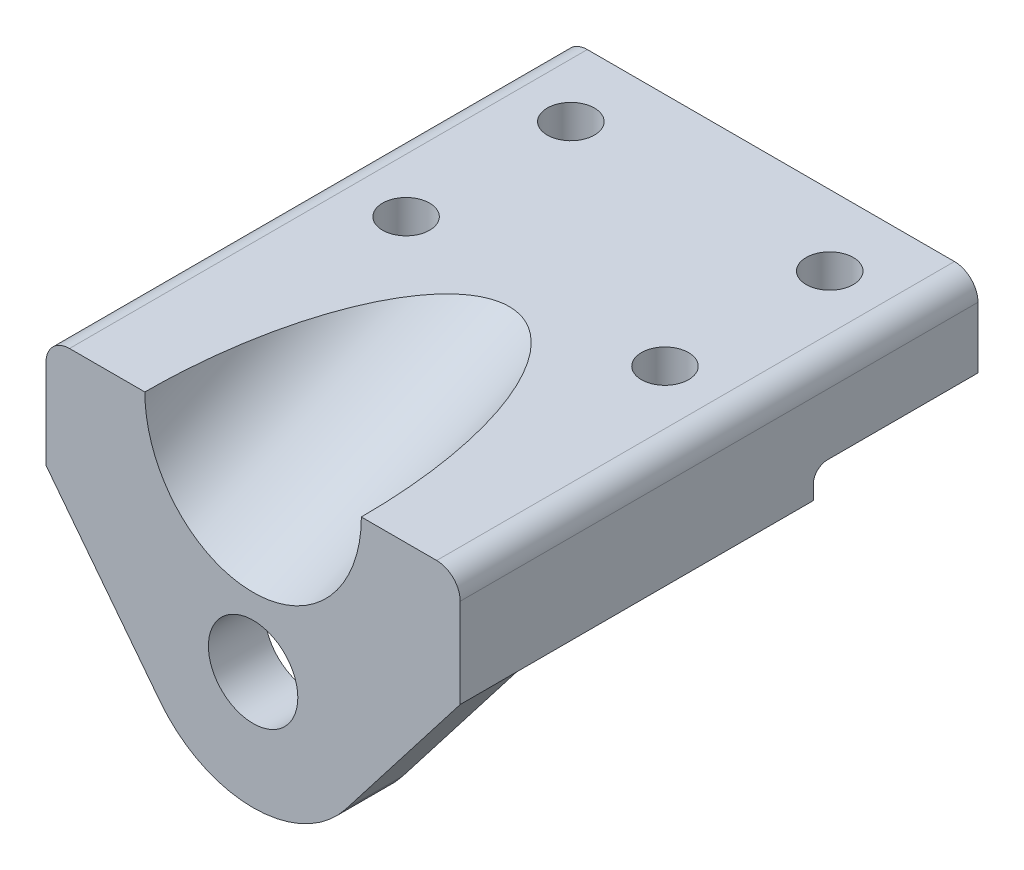
ISO-10303-21;
HEADER;
FILE_DESCRIPTION(('STEP AP214'),'2;1');
FILE_NAME('part.step','',(''),(''),'','','');
FILE_SCHEMA(('AUTOMOTIVE_DESIGN { 1 0 10303 214 1 1 1 1 }'));
ENDSEC;
DATA;
#1=APPLICATION_CONTEXT('core data for automotive mechanical design processes');
#2=APPLICATION_PROTOCOL_DEFINITION('international standard','automotive_design',2000,#1);
#3=PRODUCT_CONTEXT('',#1,'mechanical');
#4=PRODUCT('Part','Part','',(#3));
#5=PRODUCT_RELATED_PRODUCT_CATEGORY('part','',(#4));
#6=PRODUCT_DEFINITION_FORMATION('','',#4);
#7=PRODUCT_DEFINITION_CONTEXT('part definition',#1,'design');
#8=PRODUCT_DEFINITION('design','',#6,#7);
#9=PRODUCT_DEFINITION_SHAPE('','',#8);
#10=(LENGTH_UNIT() NAMED_UNIT(*) SI_UNIT(.MILLI.,.METRE.));
#11=(NAMED_UNIT(*) PLANE_ANGLE_UNIT() SI_UNIT($,.RADIAN.));
#12=(NAMED_UNIT(*) SI_UNIT($,.STERADIAN.) SOLID_ANGLE_UNIT());
#13=UNCERTAINTY_MEASURE_WITH_UNIT(LENGTH_MEASURE(1.E-05),#10,'distance_accuracy_value','');
#14=(GEOMETRIC_REPRESENTATION_CONTEXT(3) GLOBAL_UNCERTAINTY_ASSIGNED_CONTEXT((#13)) GLOBAL_UNIT_ASSIGNED_CONTEXT((#10,
#11,#12)) REPRESENTATION_CONTEXT('',''));
#15=CARTESIAN_POINT('',(0.,0.,0.));
#16=DIRECTION('',(0.,0.,1.));
#17=DIRECTION('',(1.,0.,0.));
#18=AXIS2_PLACEMENT_3D('',#15,#16,#17);
#19=CARTESIAN_POINT('',(0.,-6.,0.));
#20=DIRECTION('',(0.,-1.,0.));
#21=DIRECTION('',(0.,0.,-1.));
#22=AXIS2_PLACEMENT_3D('',#19,#20,#21);
#23=PLANE('',#22);
#24=CARTESIAN_POINT('',(-27.4999999999996,-6.,-5.));
#25=DIRECTION('',(0.,-1.,0.));
#26=DIRECTION('',(0.,0.,-1.));
#27=AXIS2_PLACEMENT_3D('',#24,#25,#26);
#28=CIRCLE('',#27,5.);
#29=CARTESIAN_POINT('',(-27.4999999999996,-6.,-10.));
#30=VERTEX_POINT('',#29);
#31=EDGE_CURVE('E159',#30,#30,#28,.T.);
#32=ORIENTED_EDGE('',*,*,#31,.F.);
#33=EDGE_LOOP('',(#32));
#34=FACE_BOUND('',#33,.T.);
#35=CARTESIAN_POINT('',(27.5000000000004,-6.,-5.));
#36=DIRECTION('',(0.,-1.,0.));
#37=DIRECTION('',(0.,0.,-1.));
#38=AXIS2_PLACEMENT_3D('',#35,#36,#37);
#39=CIRCLE('',#38,5.);
#40=CARTESIAN_POINT('',(27.5000000000004,-6.,-10.));
#41=VERTEX_POINT('',#40);
#42=EDGE_CURVE('E188',#41,#41,#39,.T.);
#43=ORIENTED_EDGE('',*,*,#42,.F.);
#44=EDGE_LOOP('',(#43));
#45=FACE_BOUND('',#44,.T.);
#46=DIRECTION('',(0.,0.,1.));
#47=VECTOR('',#46,1.);
#48=CARTESIAN_POINT('',(44.,-6.,55.));
#49=LINE('',#48,#47);
#50=CARTESIAN_POINT('',(44.,-6.,-20.));
#51=VERTEX_POINT('',#50);
#52=CARTESIAN_POINT('',(44.,-6.,43.));
#53=VERTEX_POINT('',#52);
#54=EDGE_CURVE('E240',#51,#53,#49,.T.);
#55=ORIENTED_EDGE('',*,*,#54,.T.);
#56=DIRECTION('',(-1.,0.,0.));
#57=VECTOR('',#56,1.);
#58=CARTESIAN_POINT('',(-44.,-6.,43.));
#59=LINE('',#58,#57);
#60=CARTESIAN_POINT('',(-44.,-6.,43.));
#61=VERTEX_POINT('',#60);
#62=EDGE_CURVE('E207',#53,#61,#59,.T.);
#63=ORIENTED_EDGE('',*,*,#62,.T.);
#64=DIRECTION('',(0.,0.,-1.));
#65=VECTOR('',#64,1.);
#66=CARTESIAN_POINT('',(-44.,-6.,55.));
#67=LINE('',#66,#65);
#68=CARTESIAN_POINT('',(-44.,-6.,-20.));
#69=VERTEX_POINT('',#68);
#70=EDGE_CURVE('E231',#61,#69,#67,.T.);
#71=ORIENTED_EDGE('',*,*,#70,.T.);
#72=DIRECTION('',(1.,0.,0.));
#73=VECTOR('',#72,1.);
#74=CARTESIAN_POINT('',(-44.,-6.,-20.));
#75=LINE('',#74,#73);
#76=EDGE_CURVE('E238',#69,#51,#75,.T.);
#77=ORIENTED_EDGE('',*,*,#76,.T.);
#78=EDGE_LOOP('',(#55,#63,#71,#77));
#79=FACE_BOUND('',#78,.T.);
#80=ADVANCED_FACE('F42',(#34,#45,#79),#23,.T.);
#81=CARTESIAN_POINT('',(0.,0.,0.));
#82=DIRECTION('',(0.,1.,0.));
#83=DIRECTION('',(0.,0.,1.));
#84=AXIS2_PLACEMENT_3D('',#81,#82,#83);
#85=PLANE('',#84);
#86=CARTESIAN_POINT('',(27.5,0.,-40.));
#87=DIRECTION('',(0.,1.,0.));
#88=DIRECTION('',(0.,0.,1.));
#89=AXIS2_PLACEMENT_3D('',#86,#87,#88);
#90=CIRCLE('',#89,5.);
#91=CARTESIAN_POINT('',(27.5,0.,-35.));
#92=VERTEX_POINT('',#91);
#93=EDGE_CURVE('E185',#92,#92,#90,.T.);
#94=ORIENTED_EDGE('',*,*,#93,.T.);
#95=EDGE_LOOP('',(#94));
#96=FACE_BOUND('',#95,.T.);
#97=CARTESIAN_POINT('',(-27.5,0.,-40.));
#98=DIRECTION('',(0.,1.,0.));
#99=DIRECTION('',(0.,0.,1.));
#100=AXIS2_PLACEMENT_3D('',#97,#98,#99);
#101=CIRCLE('',#100,5.);
#102=CARTESIAN_POINT('',(-27.5,0.,-35.));
#103=VERTEX_POINT('',#102);
#104=EDGE_CURVE('E182',#103,#103,#101,.T.);
#105=ORIENTED_EDGE('',*,*,#104,.T.);
#106=EDGE_LOOP('',(#105));
#107=FACE_BOUND('',#106,.T.);
#108=DIRECTION('',(0.,0.,-1.));
#109=VECTOR('',#108,1.);
#110=CARTESIAN_POINT('',(44.,0.,-55.));
#111=LINE('',#110,#109);
#112=CARTESIAN_POINT('',(44.,0.,-23.));
#113=VERTEX_POINT('',#112);
#114=CARTESIAN_POINT('',(44.,0.,-55.));
#115=VERTEX_POINT('',#114);
#116=EDGE_CURVE('E249',#113,#115,#111,.T.);
#117=ORIENTED_EDGE('',*,*,#116,.F.);
#118=DIRECTION('',(1.,0.,0.));
#119=VECTOR('',#118,1.);
#120=CARTESIAN_POINT('',(-44.,0.,-23.));
#121=LINE('',#120,#119);
#122=CARTESIAN_POINT('',(-44.,0.,-23.));
#123=VERTEX_POINT('',#122);
#124=EDGE_CURVE('E270',#113,#123,#121,.F.);
#125=ORIENTED_EDGE('',*,*,#124,.T.);
#126=DIRECTION('',(0.,0.,1.));
#127=VECTOR('',#126,1.);
#128=CARTESIAN_POINT('',(-44.,0.,-55.));
#129=LINE('',#128,#127);
#130=CARTESIAN_POINT('',(-44.,0.,-55.));
#131=VERTEX_POINT('',#130);
#132=EDGE_CURVE('E251',#131,#123,#129,.T.);
#133=ORIENTED_EDGE('',*,*,#132,.F.);
#134=DIRECTION('',(-1.,0.,0.));
#135=VECTOR('',#134,1.);
#136=CARTESIAN_POINT('',(-44.,0.,-55.));
#137=LINE('',#136,#135);
#138=EDGE_CURVE('E255',#115,#131,#137,.T.);
#139=ORIENTED_EDGE('',*,*,#138,.F.);
#140=EDGE_LOOP('',(#117,#125,#133,#139));
#141=FACE_BOUND('',#140,.T.);
#142=ADVANCED_FACE('F281',(#96,#107,#141),#85,.F.);
#143=CARTESIAN_POINT('',(44.,18.,-55.));
#144=DIRECTION('',(-1.,0.,0.));
#145=DIRECTION('',(0.,0.,1.));
#146=AXIS2_PLACEMENT_3D('',#143,#144,#145);
#147=PLANE('',#146);
#148=DIRECTION('',(0.,-1.,0.));
#149=VECTOR('',#148,1.);
#150=CARTESIAN_POINT('',(44.,18.,-55.));
#151=LINE('',#150,#149);
#152=CARTESIAN_POINT('',(44.,13.,-55.));
#153=VERTEX_POINT('',#152);
#154=EDGE_CURVE('E265',#153,#115,#151,.T.);
#155=ORIENTED_EDGE('',*,*,#154,.F.);
#156=DIRECTION('',(0.,0.,-1.));
#157=VECTOR('',#156,1.);
#158=CARTESIAN_POINT('',(44.,13.,55.));
#159=LINE('',#158,#157);
#160=CARTESIAN_POINT('',(44.,13.,55.));
#161=VERTEX_POINT('',#160);
#162=EDGE_CURVE('E11',#153,#161,#159,.F.);
#163=ORIENTED_EDGE('',*,*,#162,.T.);
#164=DIRECTION('',(0.,-1.,0.));
#165=VECTOR('',#164,1.);
#166=CARTESIAN_POINT('',(44.,18.,55.));
#167=LINE('',#166,#165);
#168=CARTESIAN_POINT('',(44.,-6.,55.));
#169=VERTEX_POINT('',#168);
#170=EDGE_CURVE('E150',#161,#169,#167,.T.);
#171=ORIENTED_EDGE('',*,*,#170,.T.);
#172=DIRECTION('',(0.,0.,1.));
#173=VECTOR('',#172,1.);
#174=CARTESIAN_POINT('',(44.,-6.,43.));
#175=LINE('',#174,#173);
#176=EDGE_CURVE('E228',#53,#169,#175,.T.);
#177=ORIENTED_EDGE('',*,*,#176,.F.);
#178=ORIENTED_EDGE('',*,*,#54,.F.);
#179=DIRECTION('',(0.,1.,0.));
#180=VECTOR('',#179,1.);
#181=CARTESIAN_POINT('',(44.,-6.,-20.));
#182=LINE('',#181,#180);
#183=CARTESIAN_POINT('',(44.,-3.,-20.));
#184=VERTEX_POINT('',#183);
#185=EDGE_CURVE('E243',#51,#184,#182,.T.);
#186=ORIENTED_EDGE('',*,*,#185,.T.);
#187=CARTESIAN_POINT('',(44.,-3.,-23.));
#188=DIRECTION('',(-1.,0.,0.));
#189=DIRECTION('',(0.,0.,1.));
#190=AXIS2_PLACEMENT_3D('',#187,#188,#189);
#191=CIRCLE('',#190,3.);
#192=EDGE_CURVE('E167',#184,#113,#191,.T.);
#193=ORIENTED_EDGE('',*,*,#192,.T.);
#194=ORIENTED_EDGE('',*,*,#116,.T.);
#195=EDGE_LOOP('',(#155,#163,#171,#177,#178,#186,#193,#194));
#196=FACE_BOUND('',#195,.T.);
#197=ADVANCED_FACE('F273',(#196),#147,.F.);
#198=CARTESIAN_POINT('',(-44.,18.,-55.));
#199=DIRECTION('',(0.,0.,1.));
#200=DIRECTION('',(1.,0.,0.));
#201=AXIS2_PLACEMENT_3D('',#198,#199,#200);
#202=PLANE('',#201);
#203=DIRECTION('',(0.,-1.,0.));
#204=VECTOR('',#203,1.);
#205=CARTESIAN_POINT('',(-44.,18.,-55.));
#206=LINE('',#205,#204);
#207=CARTESIAN_POINT('',(-44.,13.,-55.));
#208=VERTEX_POINT('',#207);
#209=EDGE_CURVE('E263',#208,#131,#206,.T.);
#210=ORIENTED_EDGE('',*,*,#209,.F.);
#211=CARTESIAN_POINT('',(-39.,13.,-55.));
#212=DIRECTION('',(0.,0.,1.));
#213=DIRECTION('',(1.,0.,0.));
#214=AXIS2_PLACEMENT_3D('',#211,#212,#213);
#215=CIRCLE('',#214,5.);
#216=CARTESIAN_POINT('',(-39.,18.,-55.));
#217=VERTEX_POINT('',#216);
#218=EDGE_CURVE('E51',#208,#217,#215,.F.);
#219=ORIENTED_EDGE('',*,*,#218,.T.);
#220=DIRECTION('',(-1.,0.,0.));
#221=VECTOR('',#220,1.);
#222=CARTESIAN_POINT('',(-44.,18.,-55.));
#223=LINE('',#222,#221);
#224=CARTESIAN_POINT('',(39.,18.,-55.));
#225=VERTEX_POINT('',#224);
#226=EDGE_CURVE('E250',#225,#217,#223,.T.);
#227=ORIENTED_EDGE('',*,*,#226,.F.);
#228=CARTESIAN_POINT('',(39.,13.,-55.));
#229=DIRECTION('',(0.,0.,1.));
#230=DIRECTION('',(1.,0.,0.));
#231=AXIS2_PLACEMENT_3D('',#228,#229,#230);
#232=CIRCLE('',#231,5.);
#233=EDGE_CURVE('E59',#225,#153,#232,.F.);
#234=ORIENTED_EDGE('',*,*,#233,.T.);
#235=ORIENTED_EDGE('',*,*,#154,.T.);
#236=ORIENTED_EDGE('',*,*,#138,.T.);
#237=EDGE_LOOP('',(#210,#219,#227,#234,#235,#236));
#238=FACE_BOUND('',#237,.T.);
#239=ADVANCED_FACE('F301',(#238),#202,.F.);
#240=CARTESIAN_POINT('',(-44.,18.,-55.));
#241=DIRECTION('',(1.,0.,0.));
#242=DIRECTION('',(0.,0.,-1.));
#243=AXIS2_PLACEMENT_3D('',#240,#241,#242);
#244=PLANE('',#243);
#245=DIRECTION('',(0.,-1.,0.));
#246=VECTOR('',#245,1.);
#247=CARTESIAN_POINT('',(-44.,18.,55.));
#248=LINE('',#247,#246);
#249=CARTESIAN_POINT('',(-44.,13.,55.));
#250=VERTEX_POINT('',#249);
#251=CARTESIAN_POINT('',(-44.,-6.,55.));
#252=VERTEX_POINT('',#251);
#253=EDGE_CURVE('E261',#250,#252,#248,.T.);
#254=ORIENTED_EDGE('',*,*,#253,.F.);
#255=DIRECTION('',(0.,0.,1.));
#256=VECTOR('',#255,1.);
#257=CARTESIAN_POINT('',(-44.,13.,-55.));
#258=LINE('',#257,#256);
#259=EDGE_CURVE('E67',#250,#208,#258,.F.);
#260=ORIENTED_EDGE('',*,*,#259,.T.);
#261=ORIENTED_EDGE('',*,*,#209,.T.);
#262=ORIENTED_EDGE('',*,*,#132,.T.);
#263=CARTESIAN_POINT('',(-44.,-3.,-23.));
#264=DIRECTION('',(1.,0.,0.));
#265=DIRECTION('',(0.,0.,-1.));
#266=AXIS2_PLACEMENT_3D('',#263,#264,#265);
#267=CIRCLE('',#266,3.);
#268=CARTESIAN_POINT('',(-44.,-3.,-20.));
#269=VERTEX_POINT('',#268);
#270=EDGE_CURVE('E163',#123,#269,#267,.T.);
#271=ORIENTED_EDGE('',*,*,#270,.T.);
#272=DIRECTION('',(0.,1.,0.));
#273=VECTOR('',#272,1.);
#274=CARTESIAN_POINT('',(-44.,-6.,-20.));
#275=LINE('',#274,#273);
#276=EDGE_CURVE('E246',#69,#269,#275,.T.);
#277=ORIENTED_EDGE('',*,*,#276,.F.);
#278=ORIENTED_EDGE('',*,*,#70,.F.);
#279=EDGE_CURVE('E235',#252,#61,#67,.T.);
#280=ORIENTED_EDGE('',*,*,#279,.F.);
#281=EDGE_LOOP('',(#254,#260,#261,#262,#271,#277,#278,#280));
#282=FACE_BOUND('',#281,.T.);
#283=ADVANCED_FACE('F286',(#282),#244,.F.);
#284=CARTESIAN_POINT('',(-44.,18.,55.));
#285=DIRECTION('',(0.,0.,-1.));
#286=DIRECTION('',(-1.,0.,0.));
#287=AXIS2_PLACEMENT_3D('',#284,#285,#286);
#288=PLANE('',#287);
#289=DIRECTION('',(1.,0.,0.));
#290=VECTOR('',#289,1.);
#291=CARTESIAN_POINT('',(-44.,18.,55.));
#292=LINE('',#291,#290);
#293=CARTESIAN_POINT('',(-39.,18.,55.));
#294=VERTEX_POINT('',#293);
#295=CARTESIAN_POINT('',(-23.,18.,55.));
#296=VERTEX_POINT('',#295);
#297=EDGE_CURVE('E139',#294,#296,#292,.T.);
#298=ORIENTED_EDGE('',*,*,#297,.F.);
#299=CARTESIAN_POINT('',(-39.,13.,55.));
#300=DIRECTION('',(0.,0.,-1.));
#301=DIRECTION('',(-1.,0.,0.));
#302=AXIS2_PLACEMENT_3D('',#299,#300,#301);
#303=CIRCLE('',#302,5.);
#304=EDGE_CURVE('E174',#294,#250,#303,.F.);
#305=ORIENTED_EDGE('',*,*,#304,.T.);
#306=ORIENTED_EDGE('',*,*,#253,.T.);
#307=DIRECTION('',(0.612114706356877,-0.790768984129774,0.));
#308=VECTOR('',#307,1.);
#309=CARTESIAN_POINT('',(-44.,-6.,55.));
#310=LINE('',#309,#308);
#311=CARTESIAN_POINT('',(-19.7692246032443,-37.3028676589219,55.));
#312=VERTEX_POINT('',#311);
#313=EDGE_CURVE('E204',#252,#312,#310,.T.);
#314=ORIENTED_EDGE('',*,*,#313,.T.);
#315=CARTESIAN_POINT('',(0.,-22.,55.));
#316=DIRECTION('',(0.,0.,1.));
#317=DIRECTION('',(1.,0.,0.));
#318=AXIS2_PLACEMENT_3D('',#315,#316,#317);
#319=CIRCLE('',#318,25.);
#320=CARTESIAN_POINT('',(19.7692246032443,-37.3028676589219,55.));
#321=VERTEX_POINT('',#320);
#322=EDGE_CURVE('E223',#312,#321,#319,.T.);
#323=ORIENTED_EDGE('',*,*,#322,.T.);
#324=DIRECTION('',(0.612114706356877,0.790768984129774,0.));
#325=VECTOR('',#324,1.);
#326=CARTESIAN_POINT('',(44.,-6.,55.));
#327=LINE('',#326,#325);
#328=EDGE_CURVE('E211',#321,#169,#327,.T.);
#329=ORIENTED_EDGE('',*,*,#328,.T.);
#330=ORIENTED_EDGE('',*,*,#170,.F.);
#331=CARTESIAN_POINT('',(39.,13.,55.));
#332=DIRECTION('',(0.,0.,-1.));
#333=DIRECTION('',(-1.,0.,0.));
#334=AXIS2_PLACEMENT_3D('',#331,#332,#333);
#335=CIRCLE('',#334,5.);
#336=CARTESIAN_POINT('',(39.,18.,55.));
#337=VERTEX_POINT('',#336);
#338=EDGE_CURVE('E172',#161,#337,#335,.F.);
#339=ORIENTED_EDGE('',*,*,#338,.T.);
#340=CARTESIAN_POINT('',(23.,18.,55.));
#341=VERTEX_POINT('',#340);
#342=EDGE_CURVE('E151',#341,#337,#292,.T.);
#343=ORIENTED_EDGE('',*,*,#342,.F.);
#344=CARTESIAN_POINT('',(0.,18.,55.));
#345=DIRECTION('',(0.,0.,-1.));
#346=DIRECTION('',(0.,-1.,0.));
#347=AXIS2_PLACEMENT_3D('',#344,#345,#346);
#348=ELLIPSE('',#347,25.3776921361373,23.);
#349=EDGE_CURVE('E154',#341,#296,#348,.T.);
#350=ORIENTED_EDGE('',*,*,#349,.T.);
#351=EDGE_LOOP('',(#298,#305,#306,#314,#323,#329,#330,#339,#343,#350));
#352=FACE_BOUND('',#351,.T.);
#353=CARTESIAN_POINT('',(0.,-22.,55.));
#354=DIRECTION('',(0.,0.,1.));
#355=DIRECTION('',(1.,0.,0.));
#356=AXIS2_PLACEMENT_3D('',#353,#354,#355);
#357=CIRCLE('',#356,9.5);
#358=CARTESIAN_POINT('',(9.5,-22.,55.));
#359=VERTEX_POINT('',#358);
#360=EDGE_CURVE('E158',#359,#359,#357,.T.);
#361=ORIENTED_EDGE('',*,*,#360,.F.);
#362=EDGE_LOOP('',(#361));
#363=FACE_BOUND('',#362,.T.);
#364=ADVANCED_FACE('F155',(#352,#363),#288,.F.);
#365=CARTESIAN_POINT('',(0.,18.,0.));
#366=DIRECTION('',(0.,1.,0.));
#367=DIRECTION('',(0.,0.,1.));
#368=AXIS2_PLACEMENT_3D('',#365,#366,#367);
#369=PLANE('',#368);
#370=CARTESIAN_POINT('',(-27.4999999999996,18.,-5.));
#371=DIRECTION('',(0.,1.,0.));
#372=DIRECTION('',(0.,0.,1.));
#373=AXIS2_PLACEMENT_3D('',#370,#371,#372);
#374=CIRCLE('',#373,5.);
#375=CARTESIAN_POINT('',(-27.4999999999996,18.,0.));
#376=VERTEX_POINT('',#375);
#377=EDGE_CURVE('E46',#376,#376,#374,.T.);
#378=ORIENTED_EDGE('',*,*,#377,.F.);
#379=EDGE_LOOP('',(#378));
#380=FACE_BOUND('',#379,.T.);
#381=CARTESIAN_POINT('',(27.5000000000004,18.,-5.));
#382=DIRECTION('',(0.,1.,0.));
#383=DIRECTION('',(0.,0.,1.));
#384=AXIS2_PLACEMENT_3D('',#381,#382,#383);
#385=CIRCLE('',#384,5.);
#386=CARTESIAN_POINT('',(27.5000000000004,18.,0.));
#387=VERTEX_POINT('',#386);
#388=EDGE_CURVE('E186',#387,#387,#385,.T.);
#389=ORIENTED_EDGE('',*,*,#388,.F.);
#390=EDGE_LOOP('',(#389));
#391=FACE_BOUND('',#390,.T.);
#392=CARTESIAN_POINT('',(27.5,18.,-40.));
#393=DIRECTION('',(0.,1.,0.));
#394=DIRECTION('',(0.,0.,1.));
#395=AXIS2_PLACEMENT_3D('',#392,#393,#394);
#396=CIRCLE('',#395,5.);
#397=CARTESIAN_POINT('',(27.5,18.,-35.));
#398=VERTEX_POINT('',#397);
#399=EDGE_CURVE('E183',#398,#398,#396,.T.);
#400=ORIENTED_EDGE('',*,*,#399,.F.);
#401=EDGE_LOOP('',(#400));
#402=FACE_BOUND('',#401,.T.);
#403=CARTESIAN_POINT('',(-27.5,18.,-40.));
#404=DIRECTION('',(0.,1.,0.));
#405=DIRECTION('',(0.,0.,1.));
#406=AXIS2_PLACEMENT_3D('',#403,#404,#405);
#407=CIRCLE('',#406,5.);
#408=CARTESIAN_POINT('',(-27.5,18.,-35.));
#409=VERTEX_POINT('',#408);
#410=EDGE_CURVE('E179',#409,#409,#407,.T.);
#411=ORIENTED_EDGE('',*,*,#410,.F.);
#412=EDGE_LOOP('',(#411));
#413=FACE_BOUND('',#412,.T.);
#414=ORIENTED_EDGE('',*,*,#226,.T.);
#415=DIRECTION('',(0.,0.,1.));
#416=VECTOR('',#415,1.);
#417=CARTESIAN_POINT('',(-39.,18.,55.));
#418=LINE('',#417,#416);
#419=EDGE_CURVE('E148',#217,#294,#418,.T.);
#420=ORIENTED_EDGE('',*,*,#419,.T.);
#421=ORIENTED_EDGE('',*,*,#297,.T.);
#422=CARTESIAN_POINT('',(0.,18.,55.));
#423=DIRECTION('',(0.,1.,0.));
#424=DIRECTION('',(0.,0.,1.));
#425=AXIS2_PLACEMENT_3D('',#422,#423,#424);
#426=ELLIPSE('',#425,54.4226364125073,23.);
#427=EDGE_CURVE('E145',#341,#296,#426,.T.);
#428=ORIENTED_EDGE('',*,*,#427,.F.);
#429=ORIENTED_EDGE('',*,*,#342,.T.);
#430=DIRECTION('',(0.,0.,-1.));
#431=VECTOR('',#430,1.);
#432=CARTESIAN_POINT('',(39.,18.,-55.));
#433=LINE('',#432,#431);
#434=EDGE_CURVE('E162',#337,#225,#433,.T.);
#435=ORIENTED_EDGE('',*,*,#434,.T.);
#436=EDGE_LOOP('',(#414,#420,#421,#428,#429,#435));
#437=FACE_BOUND('',#436,.T.);
#438=ADVANCED_FACE('F142',(#380,#391,#402,#413,#437),#369,.T.);
#439=CARTESIAN_POINT('',(-44.,-6.,-20.));
#440=DIRECTION('',(0.,0.,1.));
#441=DIRECTION('',(1.,0.,0.));
#442=AXIS2_PLACEMENT_3D('',#439,#440,#441);
#443=PLANE('',#442);
#444=ORIENTED_EDGE('',*,*,#276,.T.);
#445=DIRECTION('',(1.,0.,0.));
#446=VECTOR('',#445,1.);
#447=CARTESIAN_POINT('',(44.,-3.,-20.));
#448=LINE('',#447,#446);
#449=EDGE_CURVE('E267',#269,#184,#448,.T.);
#450=ORIENTED_EDGE('',*,*,#449,.T.);
#451=ORIENTED_EDGE('',*,*,#185,.F.);
#452=ORIENTED_EDGE('',*,*,#76,.F.);
#453=EDGE_LOOP('',(#444,#450,#451,#452));
#454=FACE_BOUND('',#453,.T.);
#455=ADVANCED_FACE('F290',(#454),#443,.F.);
#456=CARTESIAN_POINT('',(44.,-6.,43.));
#457=DIRECTION('',(0.790768984129773,-0.612114706356877,0.));
#458=DIRECTION('',(0.612114706356877,0.790768984129774,0.));
#459=AXIS2_PLACEMENT_3D('',#456,#457,#458);
#460=PLANE('',#459);
#461=ORIENTED_EDGE('',*,*,#328,.F.);
#462=DIRECTION('',(0.,0.,1.));
#463=VECTOR('',#462,1.);
#464=CARTESIAN_POINT('',(19.7692246032443,-37.3028676589219,43.));
#465=LINE('',#464,#463);
#466=CARTESIAN_POINT('',(19.7692246032443,-37.3028676589219,43.));
#467=VERTEX_POINT('',#466);
#468=EDGE_CURVE('E232',#467,#321,#465,.T.);
#469=ORIENTED_EDGE('',*,*,#468,.F.);
#470=DIRECTION('',(0.612114706356877,0.790768984129774,0.));
#471=VECTOR('',#470,1.);
#472=CARTESIAN_POINT('',(44.,-6.,43.));
#473=LINE('',#472,#471);
#474=EDGE_CURVE('E217',#467,#53,#473,.T.);
#475=ORIENTED_EDGE('',*,*,#474,.T.);
#476=ORIENTED_EDGE('',*,*,#176,.T.);
#477=EDGE_LOOP('',(#461,#469,#475,#476));
#478=FACE_BOUND('',#477,.T.);
#479=ADVANCED_FACE('F309',(#478),#460,.T.);
#480=CARTESIAN_POINT('',(0.,-22.,43.));
#481=DIRECTION('',(0.,0.,1.));
#482=DIRECTION('',(1.,0.,0.));
#483=AXIS2_PLACEMENT_3D('',#480,#481,#482);
#484=CYLINDRICAL_SURFACE('',#483,25.);
#485=ORIENTED_EDGE('',*,*,#322,.F.);
#486=DIRECTION('',(0.,0.,1.));
#487=VECTOR('',#486,1.);
#488=CARTESIAN_POINT('',(-19.7692246032443,-37.3028676589219,43.));
#489=LINE('',#488,#487);
#490=CARTESIAN_POINT('',(-19.7692246032443,-37.3028676589219,43.));
#491=VERTEX_POINT('',#490);
#492=EDGE_CURVE('E220',#491,#312,#489,.T.);
#493=ORIENTED_EDGE('',*,*,#492,.F.);
#494=CARTESIAN_POINT('',(0.,-22.,43.));
#495=DIRECTION('',(0.,0.,1.));
#496=DIRECTION('',(1.,0.,0.));
#497=AXIS2_PLACEMENT_3D('',#494,#495,#496);
#498=CIRCLE('',#497,25.);
#499=EDGE_CURVE('E214',#491,#467,#498,.T.);
#500=ORIENTED_EDGE('',*,*,#499,.T.);
#501=ORIENTED_EDGE('',*,*,#468,.T.);
#502=EDGE_LOOP('',(#485,#493,#500,#501));
#503=FACE_BOUND('',#502,.T.);
#504=ADVANCED_FACE('F315',(#503),#484,.T.);
#505=CARTESIAN_POINT('',(-44.,-6.,43.));
#506=DIRECTION('',(-0.790768984129774,-0.612114706356877,0.));
#507=DIRECTION('',(0.612114706356877,-0.790768984129774,0.));
#508=AXIS2_PLACEMENT_3D('',#505,#506,#507);
#509=PLANE('',#508);
#510=ORIENTED_EDGE('',*,*,#313,.F.);
#511=ORIENTED_EDGE('',*,*,#279,.T.);
#512=DIRECTION('',(0.612114706356877,-0.790768984129774,0.));
#513=VECTOR('',#512,1.);
#514=CARTESIAN_POINT('',(-44.,-6.,43.));
#515=LINE('',#514,#513);
#516=EDGE_CURVE('E210',#61,#491,#515,.T.);
#517=ORIENTED_EDGE('',*,*,#516,.T.);
#518=ORIENTED_EDGE('',*,*,#492,.T.);
#519=EDGE_LOOP('',(#510,#511,#517,#518));
#520=FACE_BOUND('',#519,.T.);
#521=ADVANCED_FACE('F295',(#520),#509,.T.);
#522=CARTESIAN_POINT('',(0.,-22.,43.));
#523=DIRECTION('',(0.,0.,1.));
#524=DIRECTION('',(1.,0.,0.));
#525=AXIS2_PLACEMENT_3D('',#522,#523,#524);
#526=PLANE('',#525);
#527=CARTESIAN_POINT('',(0.,-22.,43.));
#528=DIRECTION('',(0.,0.,1.));
#529=DIRECTION('',(1.,0.,0.));
#530=AXIS2_PLACEMENT_3D('',#527,#528,#529);
#531=CIRCLE('',#530,9.5);
#532=CARTESIAN_POINT('',(9.5,-22.,43.));
#533=VERTEX_POINT('',#532);
#534=EDGE_CURVE('E201',#533,#533,#531,.T.);
#535=ORIENTED_EDGE('',*,*,#534,.T.);
#536=EDGE_LOOP('',(#535));
#537=FACE_BOUND('',#536,.T.);
#538=ORIENTED_EDGE('',*,*,#62,.F.);
#539=ORIENTED_EDGE('',*,*,#474,.F.);
#540=ORIENTED_EDGE('',*,*,#499,.F.);
#541=ORIENTED_EDGE('',*,*,#516,.F.);
#542=EDGE_LOOP('',(#538,#539,#540,#541));
#543=FACE_BOUND('',#542,.T.);
#544=ADVANCED_FACE('F313',(#537,#543),#526,.F.);
#545=CARTESIAN_POINT('',(0.,-22.,43.));
#546=DIRECTION('',(0.,0.,1.));
#547=DIRECTION('',(1.,0.,0.));
#548=AXIS2_PLACEMENT_3D('',#545,#546,#547);
#549=CYLINDRICAL_SURFACE('',#548,9.5);
#550=ORIENTED_EDGE('',*,*,#534,.F.);
#551=EDGE_LOOP('',(#550));
#552=FACE_BOUND('',#551,.T.);
#553=ORIENTED_EDGE('',*,*,#360,.T.);
#554=EDGE_LOOP('',(#553));
#555=FACE_BOUND('',#554,.T.);
#556=ADVANCED_FACE('F349',(#552,#555),#549,.F.);
#557=CARTESIAN_POINT('',(-44.,-3.,-23.));
#558=DIRECTION('',(-1.,0.,0.));
#559=DIRECTION('',(0.,0.,1.));
#560=AXIS2_PLACEMENT_3D('',#557,#558,#559);
#561=CYLINDRICAL_SURFACE('',#560,3.);
#562=ORIENTED_EDGE('',*,*,#270,.F.);
#563=ORIENTED_EDGE('',*,*,#124,.F.);
#564=ORIENTED_EDGE('',*,*,#192,.F.);
#565=ORIENTED_EDGE('',*,*,#449,.F.);
#566=EDGE_LOOP('',(#562,#563,#564,#565));
#567=FACE_BOUND('',#566,.T.);
#568=ADVANCED_FACE('F284',(#567),#561,.F.);
#569=CARTESIAN_POINT('',(0.,18.,55.));
#570=DIRECTION('',(0.,-0.422618261740701,0.906307787036649));
#571=DIRECTION('',(0.,-0.906307787036649,-0.422618261740701));
#572=AXIS2_PLACEMENT_3D('',#569,#570,#571);
#573=CYLINDRICAL_SURFACE('',#572,23.);
#574=ORIENTED_EDGE('',*,*,#349,.F.);
#575=ORIENTED_EDGE('',*,*,#427,.T.);
#576=EDGE_LOOP('',(#574,#575));
#577=FACE_BOUND('',#576,.T.);
#578=ADVANCED_FACE('F161',(#577),#573,.F.);
#579=CARTESIAN_POINT('',(-39.,13.,0.));
#580=DIRECTION('',(0.,0.,-1.));
#581=DIRECTION('',(-1.,0.,0.));
#582=AXIS2_PLACEMENT_3D('',#579,#580,#581);
#583=CYLINDRICAL_SURFACE('',#582,5.);
#584=ORIENTED_EDGE('',*,*,#218,.F.);
#585=ORIENTED_EDGE('',*,*,#259,.F.);
#586=ORIENTED_EDGE('',*,*,#304,.F.);
#587=ORIENTED_EDGE('',*,*,#419,.F.);
#588=EDGE_LOOP('',(#584,#585,#586,#587));
#589=FACE_BOUND('',#588,.T.);
#590=ADVANCED_FACE('F300',(#589),#583,.T.);
#591=CARTESIAN_POINT('',(39.,13.,0.));
#592=DIRECTION('',(0.,0.,1.));
#593=DIRECTION('',(1.,0.,0.));
#594=AXIS2_PLACEMENT_3D('',#591,#592,#593);
#595=CYLINDRICAL_SURFACE('',#594,5.);
#596=ORIENTED_EDGE('',*,*,#338,.F.);
#597=ORIENTED_EDGE('',*,*,#162,.F.);
#598=ORIENTED_EDGE('',*,*,#233,.F.);
#599=ORIENTED_EDGE('',*,*,#434,.F.);
#600=EDGE_LOOP('',(#596,#597,#598,#599));
#601=FACE_BOUND('',#600,.T.);
#602=ADVANCED_FACE('F44',(#601),#595,.T.);
#603=CARTESIAN_POINT('',(-27.5,-47.,-40.));
#604=DIRECTION('',(0.,1.,0.));
#605=DIRECTION('',(0.,0.,1.));
#606=AXIS2_PLACEMENT_3D('',#603,#604,#605);
#607=CYLINDRICAL_SURFACE('',#606,5.);
#608=ORIENTED_EDGE('',*,*,#410,.T.);
#609=EDGE_LOOP('',(#608));
#610=FACE_BOUND('',#609,.T.);
#611=ORIENTED_EDGE('',*,*,#104,.F.);
#612=EDGE_LOOP('',(#611));
#613=FACE_BOUND('',#612,.T.);
#614=ADVANCED_FACE('F355',(#610,#613),#607,.F.);
#615=CARTESIAN_POINT('',(27.5,-47.,-40.));
#616=DIRECTION('',(0.,1.,0.));
#617=DIRECTION('',(0.,0.,1.));
#618=AXIS2_PLACEMENT_3D('',#615,#616,#617);
#619=CYLINDRICAL_SURFACE('',#618,5.);
#620=ORIENTED_EDGE('',*,*,#399,.T.);
#621=EDGE_LOOP('',(#620));
#622=FACE_BOUND('',#621,.T.);
#623=ORIENTED_EDGE('',*,*,#93,.F.);
#624=EDGE_LOOP('',(#623));
#625=FACE_BOUND('',#624,.T.);
#626=ADVANCED_FACE('F429',(#622,#625),#619,.F.);
#627=CARTESIAN_POINT('',(27.5000000000004,-47.,-5.));
#628=DIRECTION('',(0.,1.,0.));
#629=DIRECTION('',(0.,0.,1.));
#630=AXIS2_PLACEMENT_3D('',#627,#628,#629);
#631=CYLINDRICAL_SURFACE('',#630,5.);
#632=ORIENTED_EDGE('',*,*,#42,.T.);
#633=EDGE_LOOP('',(#632));
#634=FACE_BOUND('',#633,.T.);
#635=ORIENTED_EDGE('',*,*,#388,.T.);
#636=EDGE_LOOP('',(#635));
#637=FACE_BOUND('',#636,.T.);
#638=ADVANCED_FACE('F435',(#634,#637),#631,.F.);
#639=CARTESIAN_POINT('',(-27.4999999999996,-47.,-5.));
#640=DIRECTION('',(0.,1.,0.));
#641=DIRECTION('',(0.,0.,1.));
#642=AXIS2_PLACEMENT_3D('',#639,#640,#641);
#643=CYLINDRICAL_SURFACE('',#642,5.);
#644=ORIENTED_EDGE('',*,*,#31,.T.);
#645=EDGE_LOOP('',(#644));
#646=FACE_BOUND('',#645,.T.);
#647=ORIENTED_EDGE('',*,*,#377,.T.);
#648=EDGE_LOOP('',(#647));
#649=FACE_BOUND('',#648,.T.);
#650=ADVANCED_FACE('F443',(#646,#649),#643,.F.);
#651=CLOSED_SHELL('',(#80,#142,#197,#239,#283,#364,#438,#455,#479,#504,#521,#544,#556,#568,#578,
#590,#602,#614,#626,#638,#650));
#652=MANIFOLD_SOLID_BREP('B2',#651);
#653=ADVANCED_BREP_SHAPE_REPRESENTATION('',(#18,#652),#14);
#654=SHAPE_DEFINITION_REPRESENTATION(#9,#653);
ENDSEC;
END-ISO-10303-21;
